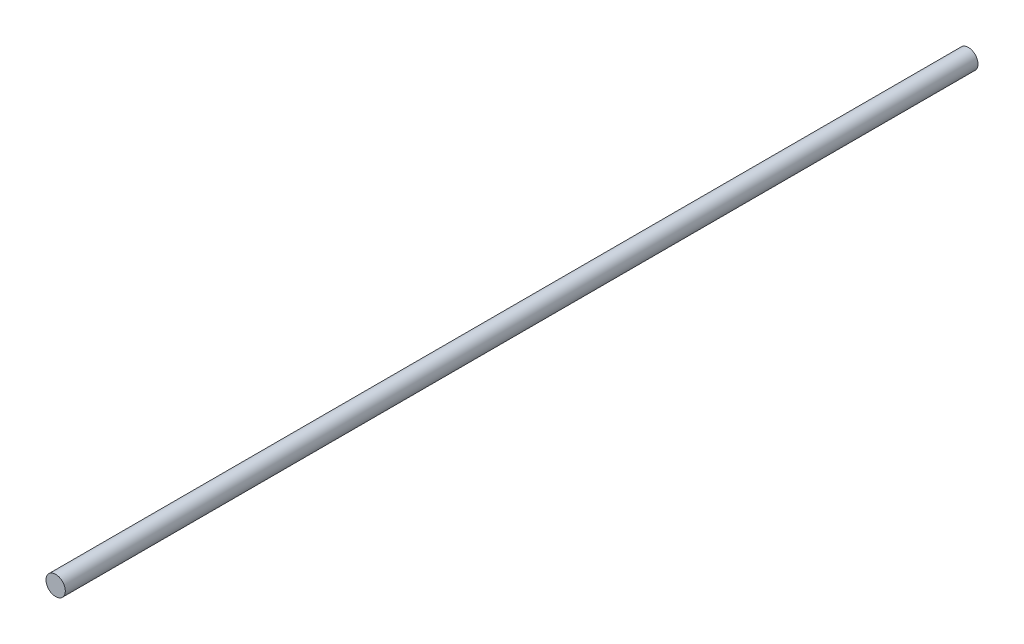
ISO-10303-21;
HEADER;
FILE_DESCRIPTION(('STEP AP214'),'2;1');
FILE_NAME('part.step','',(''),(''),'','','');
FILE_SCHEMA(('AUTOMOTIVE_DESIGN { 1 0 10303 214 1 1 1 1 }'));
ENDSEC;
DATA;
#1=APPLICATION_CONTEXT('core data for automotive mechanical design processes');
#2=APPLICATION_PROTOCOL_DEFINITION('international standard','automotive_design',2000,#1);
#3=PRODUCT_CONTEXT('',#1,'mechanical');
#4=PRODUCT('Part','Part','',(#3));
#5=PRODUCT_RELATED_PRODUCT_CATEGORY('part','',(#4));
#6=PRODUCT_DEFINITION_FORMATION('','',#4);
#7=PRODUCT_DEFINITION_CONTEXT('part definition',#1,'design');
#8=PRODUCT_DEFINITION('design','',#6,#7);
#9=PRODUCT_DEFINITION_SHAPE('','',#8);
#10=(LENGTH_UNIT() NAMED_UNIT(*) SI_UNIT(.MILLI.,.METRE.));
#11=(NAMED_UNIT(*) PLANE_ANGLE_UNIT() SI_UNIT($,.RADIAN.));
#12=(NAMED_UNIT(*) SI_UNIT($,.STERADIAN.) SOLID_ANGLE_UNIT());
#13=UNCERTAINTY_MEASURE_WITH_UNIT(LENGTH_MEASURE(1.E-05),#10,'distance_accuracy_value','');
#14=(GEOMETRIC_REPRESENTATION_CONTEXT(3) GLOBAL_UNCERTAINTY_ASSIGNED_CONTEXT((#13)) GLOBAL_UNIT_ASSIGNED_CONTEXT((#10,
#11,#12)) REPRESENTATION_CONTEXT('',''));
#15=CARTESIAN_POINT('',(0.,0.,0.));
#16=DIRECTION('',(0.,0.,1.));
#17=DIRECTION('',(1.,0.,0.));
#18=AXIS2_PLACEMENT_3D('',#15,#16,#17);
#19=CARTESIAN_POINT('',(0.,0.,189.));
#20=DIRECTION('',(0.,0.,-1.));
#21=DIRECTION('',(-1.,0.,0.));
#22=AXIS2_PLACEMENT_3D('',#19,#20,#21);
#23=CYLINDRICAL_SURFACE('',#22,2.);
#24=CARTESIAN_POINT('',(0.,0.,189.));
#25=DIRECTION('',(0.,0.,1.));
#26=DIRECTION('',(1.,0.,0.));
#27=AXIS2_PLACEMENT_3D('',#24,#25,#26);
#28=CIRCLE('',#27,2.);
#29=CARTESIAN_POINT('',(2.,0.,189.));
#30=VERTEX_POINT('',#29);
#31=EDGE_CURVE('E10',#30,#30,#28,.T.);
#32=ORIENTED_EDGE('',*,*,#31,.F.);
#33=EDGE_LOOP('',(#32));
#34=FACE_BOUND('',#33,.T.);
#35=CARTESIAN_POINT('',(0.,0.,0.));
#36=DIRECTION('',(0.,0.,1.));
#37=DIRECTION('',(1.,0.,0.));
#38=AXIS2_PLACEMENT_3D('',#35,#36,#37);
#39=CIRCLE('',#38,2.);
#40=CARTESIAN_POINT('',(2.,0.,0.));
#41=VERTEX_POINT('',#40);
#42=EDGE_CURVE('E43',#41,#41,#39,.T.);
#43=ORIENTED_EDGE('',*,*,#42,.T.);
#44=EDGE_LOOP('',(#43));
#45=FACE_BOUND('',#44,.T.);
#46=ADVANCED_FACE('F40',(#34,#45),#23,.T.);
#47=CARTESIAN_POINT('',(0.,0.,189.));
#48=DIRECTION('',(0.,0.,1.));
#49=DIRECTION('',(1.,0.,0.));
#50=AXIS2_PLACEMENT_3D('',#47,#48,#49);
#51=PLANE('',#50);
#52=ORIENTED_EDGE('',*,*,#31,.T.);
#53=EDGE_LOOP('',(#52));
#54=FACE_BOUND('',#53,.T.);
#55=ADVANCED_FACE('F57',(#54),#51,.T.);
#56=CARTESIAN_POINT('',(0.,0.,0.));
#57=DIRECTION('',(0.,0.,1.));
#58=DIRECTION('',(1.,0.,0.));
#59=AXIS2_PLACEMENT_3D('',#56,#57,#58);
#60=PLANE('',#59);
#61=ORIENTED_EDGE('',*,*,#42,.F.);
#62=EDGE_LOOP('',(#61));
#63=FACE_BOUND('',#62,.T.);
#64=ADVANCED_FACE('F55',(#63),#60,.F.);
#65=CLOSED_SHELL('',(#46,#55,#64));
#66=MANIFOLD_SOLID_BREP('B2',#65);
#67=ADVANCED_BREP_SHAPE_REPRESENTATION('',(#18,#66),#14);
#68=SHAPE_DEFINITION_REPRESENTATION(#9,#67);
ENDSEC;
END-ISO-10303-21;
